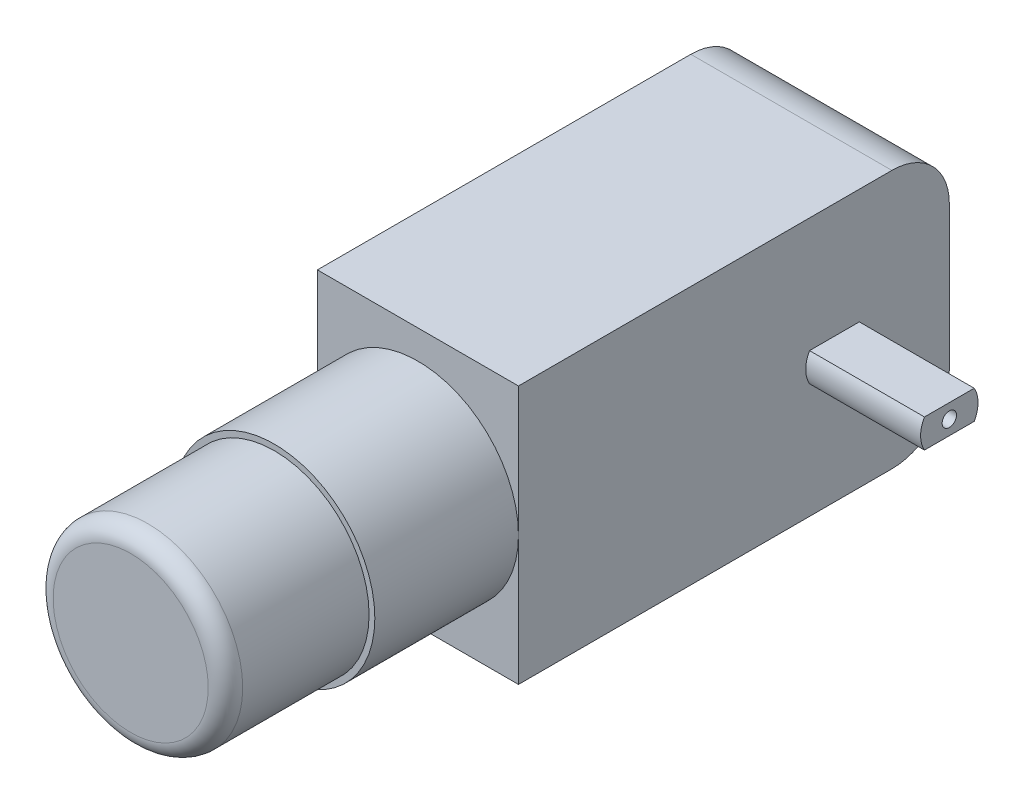
ISO-10303-21;
HEADER;
FILE_DESCRIPTION(('STEP AP214'),'2;1');
FILE_NAME('part.step','',(''),(''),'','','');
FILE_SCHEMA(('AUTOMOTIVE_DESIGN { 1 0 10303 214 1 1 1 1 }'));
ENDSEC;
DATA;
#1=APPLICATION_CONTEXT('core data for automotive mechanical design processes');
#2=APPLICATION_PROTOCOL_DEFINITION('international standard','automotive_design',2000,#1);
#3=PRODUCT_CONTEXT('',#1,'mechanical');
#4=PRODUCT('Part','Part','',(#3));
#5=PRODUCT_RELATED_PRODUCT_CATEGORY('part','',(#4));
#6=PRODUCT_DEFINITION_FORMATION('','',#4);
#7=PRODUCT_DEFINITION_CONTEXT('part definition',#1,'design');
#8=PRODUCT_DEFINITION('design','',#6,#7);
#9=PRODUCT_DEFINITION_SHAPE('','',#8);
#10=(LENGTH_UNIT() NAMED_UNIT(*) SI_UNIT(.MILLI.,.METRE.));
#11=(NAMED_UNIT(*) PLANE_ANGLE_UNIT() SI_UNIT($,.RADIAN.));
#12=(NAMED_UNIT(*) SI_UNIT($,.STERADIAN.) SOLID_ANGLE_UNIT());
#13=UNCERTAINTY_MEASURE_WITH_UNIT(LENGTH_MEASURE(1.E-05),#10,'distance_accuracy_value','');
#14=(GEOMETRIC_REPRESENTATION_CONTEXT(3) GLOBAL_UNCERTAINTY_ASSIGNED_CONTEXT((#13)) GLOBAL_UNIT_ASSIGNED_CONTEXT((#10,
#11,#12)) REPRESENTATION_CONTEXT('',''));
#15=CARTESIAN_POINT('',(0.,0.,0.));
#16=DIRECTION('',(0.,0.,1.));
#17=DIRECTION('',(1.,0.,0.));
#18=AXIS2_PLACEMENT_3D('',#15,#16,#17);
#19=CARTESIAN_POINT('',(0.,0.,0.));
#20=DIRECTION('',(-1.,0.,0.));
#21=DIRECTION('',(0.,0.,1.));
#22=AXIS2_PLACEMENT_3D('',#19,#20,#21);
#23=PLANE('',#22);
#24=DIRECTION('',(0.,1.,0.));
#25=VECTOR('',#24,1.);
#26=CARTESIAN_POINT('',(0.,-11.25,-18.75));
#27=LINE('',#26,#25);
#28=CARTESIAN_POINT('',(0.,-6.25,-18.75));
#29=VERTEX_POINT('',#28);
#30=CARTESIAN_POINT('',(0.,6.24999999999999,-18.75));
#31=VERTEX_POINT('',#30);
#32=EDGE_CURVE('E221',#29,#31,#27,.T.);
#33=ORIENTED_EDGE('',*,*,#32,.F.);
#34=CARTESIAN_POINT('',(0.,-6.25,-13.75));
#35=DIRECTION('',(-1.,0.,0.));
#36=DIRECTION('',(0.,0.,1.));
#37=AXIS2_PLACEMENT_3D('',#34,#35,#36);
#38=CIRCLE('',#37,5.);
#39=CARTESIAN_POINT('',(0.,-11.25,-13.75));
#40=VERTEX_POINT('',#39);
#41=EDGE_CURVE('E262',#29,#40,#38,.T.);
#42=ORIENTED_EDGE('',*,*,#41,.T.);
#43=DIRECTION('',(0.,0.,-1.));
#44=VECTOR('',#43,1.);
#45=CARTESIAN_POINT('',(0.,-11.25,18.75));
#46=LINE('',#45,#44);
#47=CARTESIAN_POINT('',(0.,-11.25,18.75));
#48=VERTEX_POINT('',#47);
#49=EDGE_CURVE('E226',#48,#40,#46,.T.);
#50=ORIENTED_EDGE('',*,*,#49,.F.);
#51=DIRECTION('',(0.,-1.,0.));
#52=VECTOR('',#51,1.);
#53=CARTESIAN_POINT('',(0.,-11.25,18.75));
#54=LINE('',#53,#52);
#55=CARTESIAN_POINT('',(0.,0.,18.75));
#56=VERTEX_POINT('',#55);
#57=EDGE_CURVE('E239',#56,#48,#54,.T.);
#58=ORIENTED_EDGE('',*,*,#57,.F.);
#59=CARTESIAN_POINT('',(0.,11.25,18.75));
#60=VERTEX_POINT('',#59);
#61=EDGE_CURVE('E240',#60,#56,#54,.T.);
#62=ORIENTED_EDGE('',*,*,#61,.F.);
#63=DIRECTION('',(0.,0.,1.));
#64=VECTOR('',#63,1.);
#65=CARTESIAN_POINT('',(0.,11.25,18.75));
#66=LINE('',#65,#64);
#67=CARTESIAN_POINT('',(0.,11.25,-13.75));
#68=VERTEX_POINT('',#67);
#69=EDGE_CURVE('E237',#68,#60,#66,.T.);
#70=ORIENTED_EDGE('',*,*,#69,.F.);
#71=CARTESIAN_POINT('',(0.,6.25,-13.75));
#72=DIRECTION('',(-1.,0.,0.));
#73=DIRECTION('',(0.,0.,1.));
#74=AXIS2_PLACEMENT_3D('',#71,#72,#73);
#75=CIRCLE('',#74,5.);
#76=EDGE_CURVE('E260',#68,#31,#75,.T.);
#77=ORIENTED_EDGE('',*,*,#76,.T.);
#78=EDGE_LOOP('',(#33,#42,#50,#58,#62,#70,#77));
#79=FACE_BOUND('',#78,.T.);
#80=DIRECTION('',(0.,0.,1.));
#81=VECTOR('',#80,1.);
#82=CARTESIAN_POINT('',(0.,-1.25000000000003,0.));
#83=LINE('',#82,#81);
#84=CARTESIAN_POINT('',(0.,-1.25000000000003,-10.9150635094611));
#85=VERTEX_POINT('',#84);
#86=CARTESIAN_POINT('',(0.,-1.25000000000003,-6.5849364905389));
#87=VERTEX_POINT('',#86);
#88=EDGE_CURVE('E56',#85,#87,#83,.T.);
#89=ORIENTED_EDGE('',*,*,#88,.F.);
#90=CARTESIAN_POINT('',(0.,0.,-8.75));
#91=DIRECTION('',(-1.,0.,0.));
#92=DIRECTION('',(0.,0.,1.));
#93=AXIS2_PLACEMENT_3D('',#90,#91,#92);
#94=CIRCLE('',#93,2.5);
#95=CARTESIAN_POINT('',(0.,1.24999999999997,-10.9150635094611));
#96=VERTEX_POINT('',#95);
#97=EDGE_CURVE('E168',#96,#85,#94,.T.);
#98=ORIENTED_EDGE('',*,*,#97,.F.);
#99=DIRECTION('',(0.,0.,1.));
#100=VECTOR('',#99,1.);
#101=CARTESIAN_POINT('',(0.,1.24999999999997,0.));
#102=LINE('',#101,#100);
#103=CARTESIAN_POINT('',(0.,1.24999999999997,-6.5849364905389));
#104=VERTEX_POINT('',#103);
#105=EDGE_CURVE('E165',#96,#104,#102,.T.);
#106=ORIENTED_EDGE('',*,*,#105,.T.);
#107=EDGE_CURVE('E61',#87,#104,#94,.T.);
#108=ORIENTED_EDGE('',*,*,#107,.F.);
#109=EDGE_LOOP('',(#89,#98,#106,#108));
#110=FACE_BOUND('',#109,.T.);
#111=ADVANCED_FACE('F41',(#79,#110),#23,.T.);
#112=CARTESIAN_POINT('',(17.5,-11.25,18.75));
#113=DIRECTION('',(0.,0.,-1.));
#114=DIRECTION('',(-1.,0.,0.));
#115=AXIS2_PLACEMENT_3D('',#112,#113,#114);
#116=PLANE('',#115);
#117=CARTESIAN_POINT('',(8.75,0.,18.75));
#118=DIRECTION('',(0.,0.,1.));
#119=DIRECTION('',(1.,0.,0.));
#120=AXIS2_PLACEMENT_3D('',#117,#118,#119);
#121=CIRCLE('',#120,8.75);
#122=CARTESIAN_POINT('',(17.5,0.,18.75));
#123=VERTEX_POINT('',#122);
#124=EDGE_CURVE('E169',#123,#56,#121,.T.);
#125=ORIENTED_EDGE('',*,*,#124,.F.);
#126=DIRECTION('',(0.,-1.,0.));
#127=VECTOR('',#126,1.);
#128=CARTESIAN_POINT('',(17.5,-11.25,18.75));
#129=LINE('',#128,#127);
#130=CARTESIAN_POINT('',(17.5,11.25,18.75));
#131=VERTEX_POINT('',#130);
#132=EDGE_CURVE('E229',#131,#123,#129,.T.);
#133=ORIENTED_EDGE('',*,*,#132,.F.);
#134=DIRECTION('',(-1.,0.,0.));
#135=VECTOR('',#134,1.);
#136=CARTESIAN_POINT('',(17.5,11.25,18.75));
#137=LINE('',#136,#135);
#138=EDGE_CURVE('E247',#131,#60,#137,.T.);
#139=ORIENTED_EDGE('',*,*,#138,.T.);
#140=ORIENTED_EDGE('',*,*,#61,.T.);
#141=EDGE_LOOP('',(#125,#133,#139,#140));
#142=FACE_BOUND('',#141,.T.);
#143=ADVANCED_FACE('F295',(#142),#116,.F.);
#144=CARTESIAN_POINT('',(17.5,-11.25,-18.75));
#145=DIRECTION('',(0.,0.,1.));
#146=DIRECTION('',(1.,0.,0.));
#147=AXIS2_PLACEMENT_3D('',#144,#145,#146);
#148=PLANE('',#147);
#149=DIRECTION('',(0.,1.,0.));
#150=VECTOR('',#149,1.);
#151=CARTESIAN_POINT('',(17.5,-11.25,-18.75));
#152=LINE('',#151,#150);
#153=CARTESIAN_POINT('',(17.5,-6.25,-18.75));
#154=VERTEX_POINT('',#153);
#155=CARTESIAN_POINT('',(17.5,6.24999999999999,-18.75));
#156=VERTEX_POINT('',#155);
#157=EDGE_CURVE('E222',#154,#156,#152,.T.);
#158=ORIENTED_EDGE('',*,*,#157,.F.);
#159=DIRECTION('',(-1.,0.,0.));
#160=VECTOR('',#159,1.);
#161=CARTESIAN_POINT('',(17.5,-6.25,-18.75));
#162=LINE('',#161,#160);
#163=EDGE_CURVE('E257',#154,#29,#162,.T.);
#164=ORIENTED_EDGE('',*,*,#163,.T.);
#165=ORIENTED_EDGE('',*,*,#32,.T.);
#166=DIRECTION('',(-1.,0.,0.));
#167=VECTOR('',#166,1.);
#168=CARTESIAN_POINT('',(17.5,6.25,-18.75));
#169=LINE('',#168,#167);
#170=EDGE_CURVE('E255',#31,#156,#169,.F.);
#171=ORIENTED_EDGE('',*,*,#170,.T.);
#172=EDGE_LOOP('',(#158,#164,#165,#171));
#173=FACE_BOUND('',#172,.T.);
#174=ADVANCED_FACE('F277',(#173),#148,.F.);
#175=CARTESIAN_POINT('',(17.5,11.25,18.75));
#176=DIRECTION('',(0.,-1.,0.));
#177=DIRECTION('',(0.,0.,-1.));
#178=AXIS2_PLACEMENT_3D('',#175,#176,#177);
#179=PLANE('',#178);
#180=DIRECTION('',(0.,0.,1.));
#181=VECTOR('',#180,1.);
#182=CARTESIAN_POINT('',(17.5,11.25,18.75));
#183=LINE('',#182,#181);
#184=CARTESIAN_POINT('',(17.5,11.25,-13.75));
#185=VERTEX_POINT('',#184);
#186=EDGE_CURVE('E225',#185,#131,#183,.T.);
#187=ORIENTED_EDGE('',*,*,#186,.F.);
#188=DIRECTION('',(-1.,0.,0.));
#189=VECTOR('',#188,1.);
#190=CARTESIAN_POINT('',(17.5,11.25,-13.75));
#191=LINE('',#190,#189);
#192=EDGE_CURVE('E11',#185,#68,#191,.T.);
#193=ORIENTED_EDGE('',*,*,#192,.T.);
#194=ORIENTED_EDGE('',*,*,#69,.T.);
#195=ORIENTED_EDGE('',*,*,#138,.F.);
#196=EDGE_LOOP('',(#187,#193,#194,#195));
#197=FACE_BOUND('',#196,.T.);
#198=ADVANCED_FACE('F330',(#197),#179,.F.);
#199=EDGE_CURVE('E174',#56,#123,#121,.T.);
#200=ORIENTED_EDGE('',*,*,#199,.F.);
#201=ORIENTED_EDGE('',*,*,#57,.T.);
#202=DIRECTION('',(-1.,0.,0.));
#203=VECTOR('',#202,1.);
#204=CARTESIAN_POINT('',(17.5,-11.25,18.75));
#205=LINE('',#204,#203);
#206=CARTESIAN_POINT('',(17.5,-11.25,18.75));
#207=VERTEX_POINT('',#206);
#208=EDGE_CURVE('E234',#207,#48,#205,.T.);
#209=ORIENTED_EDGE('',*,*,#208,.F.);
#210=EDGE_CURVE('E228',#123,#207,#129,.T.);
#211=ORIENTED_EDGE('',*,*,#210,.F.);
#212=EDGE_LOOP('',(#200,#201,#209,#211));
#213=FACE_BOUND('',#212,.T.);
#214=ADVANCED_FACE('F289',(#213),#116,.F.);
#215=CARTESIAN_POINT('',(17.5,-11.25,18.75));
#216=DIRECTION('',(0.,1.,0.));
#217=DIRECTION('',(0.,0.,1.));
#218=AXIS2_PLACEMENT_3D('',#215,#216,#217);
#219=PLANE('',#218);
#220=ORIENTED_EDGE('',*,*,#49,.T.);
#221=DIRECTION('',(-1.,0.,0.));
#222=VECTOR('',#221,1.);
#223=CARTESIAN_POINT('',(17.5,-11.25,-13.75));
#224=LINE('',#223,#222);
#225=CARTESIAN_POINT('',(17.5,-11.25,-13.75));
#226=VERTEX_POINT('',#225);
#227=EDGE_CURVE('E264',#40,#226,#224,.F.);
#228=ORIENTED_EDGE('',*,*,#227,.T.);
#229=DIRECTION('',(0.,0.,-1.));
#230=VECTOR('',#229,1.);
#231=CARTESIAN_POINT('',(17.5,-11.25,18.75));
#232=LINE('',#231,#230);
#233=EDGE_CURVE('E231',#207,#226,#232,.T.);
#234=ORIENTED_EDGE('',*,*,#233,.F.);
#235=ORIENTED_EDGE('',*,*,#208,.T.);
#236=EDGE_LOOP('',(#220,#228,#234,#235));
#237=FACE_BOUND('',#236,.T.);
#238=ADVANCED_FACE('F285',(#237),#219,.F.);
#239=CARTESIAN_POINT('',(17.5,0.,0.));
#240=DIRECTION('',(-1.,0.,0.));
#241=DIRECTION('',(0.,0.,1.));
#242=AXIS2_PLACEMENT_3D('',#239,#240,#241);
#243=PLANE('',#242);
#244=DIRECTION('',(0.,0.,-1.));
#245=VECTOR('',#244,1.);
#246=CARTESIAN_POINT('',(17.5,-1.25352081167518,0.));
#247=LINE('',#246,#245);
#248=CARTESIAN_POINT('',(17.5,-1.25352081167518,-6.5849364905389));
#249=VERTEX_POINT('',#248);
#250=CARTESIAN_POINT('',(17.5,-1.25352081167518,-10.9150635094611));
#251=VERTEX_POINT('',#250);
#252=EDGE_CURVE('E184',#249,#251,#247,.T.);
#253=ORIENTED_EDGE('',*,*,#252,.F.);
#254=CARTESIAN_POINT('',(17.5,-0.00352081167518357,-8.75));
#255=DIRECTION('',(1.,0.,0.));
#256=DIRECTION('',(0.,0.,-1.));
#257=AXIS2_PLACEMENT_3D('',#254,#255,#256);
#258=CIRCLE('',#257,2.5);
#259=CARTESIAN_POINT('',(17.5,1.24647918832482,-6.5849364905389));
#260=VERTEX_POINT('',#259);
#261=EDGE_CURVE('E206',#260,#249,#258,.T.);
#262=ORIENTED_EDGE('',*,*,#261,.F.);
#263=DIRECTION('',(0.,0.,-1.));
#264=VECTOR('',#263,1.);
#265=CARTESIAN_POINT('',(17.5,1.24647918832482,0.));
#266=LINE('',#265,#264);
#267=CARTESIAN_POINT('',(17.5,1.24647918832482,-10.9150635094611));
#268=VERTEX_POINT('',#267);
#269=EDGE_CURVE('E205',#260,#268,#266,.T.);
#270=ORIENTED_EDGE('',*,*,#269,.T.);
#271=EDGE_CURVE('E202',#251,#268,#258,.T.);
#272=ORIENTED_EDGE('',*,*,#271,.F.);
#273=EDGE_LOOP('',(#253,#262,#270,#272));
#274=FACE_BOUND('',#273,.T.);
#275=ORIENTED_EDGE('',*,*,#233,.T.);
#276=CARTESIAN_POINT('',(17.5,-6.25,-13.75));
#277=DIRECTION('',(-1.,0.,0.));
#278=DIRECTION('',(0.,0.,1.));
#279=AXIS2_PLACEMENT_3D('',#276,#277,#278);
#280=CIRCLE('',#279,5.);
#281=EDGE_CURVE('E49',#226,#154,#280,.F.);
#282=ORIENTED_EDGE('',*,*,#281,.T.);
#283=ORIENTED_EDGE('',*,*,#157,.T.);
#284=CARTESIAN_POINT('',(17.5,6.25,-13.75));
#285=DIRECTION('',(-1.,0.,0.));
#286=DIRECTION('',(0.,0.,1.));
#287=AXIS2_PLACEMENT_3D('',#284,#285,#286);
#288=CIRCLE('',#287,5.);
#289=EDGE_CURVE('E266',#156,#185,#288,.F.);
#290=ORIENTED_EDGE('',*,*,#289,.T.);
#291=ORIENTED_EDGE('',*,*,#186,.T.);
#292=ORIENTED_EDGE('',*,*,#132,.T.);
#293=ORIENTED_EDGE('',*,*,#210,.T.);
#294=EDGE_LOOP('',(#275,#282,#283,#290,#291,#292,#293));
#295=FACE_BOUND('',#294,.T.);
#296=ADVANCED_FACE('F270',(#274,#295),#243,.F.);
#297=CARTESIAN_POINT('',(27.5,-1.25352081167518,0.));
#298=DIRECTION('',(0.,1.,0.));
#299=DIRECTION('',(0.,0.,1.));
#300=AXIS2_PLACEMENT_3D('',#297,#298,#299);
#301=PLANE('',#300);
#302=ORIENTED_EDGE('',*,*,#252,.T.);
#303=DIRECTION('',(-1.,0.,0.));
#304=VECTOR('',#303,1.);
#305=CARTESIAN_POINT('',(27.5,-1.25352081167518,-10.9150635094611));
#306=LINE('',#305,#304);
#307=CARTESIAN_POINT('',(27.5,-1.25352081167518,-10.9150635094611));
#308=VERTEX_POINT('',#307);
#309=EDGE_CURVE('E218',#308,#251,#306,.T.);
#310=ORIENTED_EDGE('',*,*,#309,.F.);
#311=DIRECTION('',(0.,0.,-1.));
#312=VECTOR('',#311,1.);
#313=CARTESIAN_POINT('',(27.5,-1.25352081167518,0.));
#314=LINE('',#313,#312);
#315=CARTESIAN_POINT('',(27.5,-1.25352081167518,-6.5849364905389));
#316=VERTEX_POINT('',#315);
#317=EDGE_CURVE('E186',#316,#308,#314,.T.);
#318=ORIENTED_EDGE('',*,*,#317,.F.);
#319=DIRECTION('',(-1.,0.,0.));
#320=VECTOR('',#319,1.);
#321=CARTESIAN_POINT('',(27.5,-1.25352081167518,-6.5849364905389));
#322=LINE('',#321,#320);
#323=EDGE_CURVE('E199',#316,#249,#322,.T.);
#324=ORIENTED_EDGE('',*,*,#323,.T.);
#325=EDGE_LOOP('',(#302,#310,#318,#324));
#326=FACE_BOUND('',#325,.T.);
#327=ADVANCED_FACE('F478',(#326),#301,.F.);
#328=CARTESIAN_POINT('',(27.5,-0.00352081167518357,-8.75));
#329=DIRECTION('',(-1.,0.,0.));
#330=DIRECTION('',(0.,0.,1.));
#331=AXIS2_PLACEMENT_3D('',#328,#329,#330);
#332=CYLINDRICAL_SURFACE('',#331,2.5);
#333=ORIENTED_EDGE('',*,*,#271,.T.);
#334=DIRECTION('',(-1.,0.,0.));
#335=VECTOR('',#334,1.);
#336=CARTESIAN_POINT('',(27.5,1.24647918832482,-10.9150635094611));
#337=LINE('',#336,#335);
#338=CARTESIAN_POINT('',(27.5,1.24647918832482,-10.9150635094611));
#339=VERTEX_POINT('',#338);
#340=EDGE_CURVE('E215',#339,#268,#337,.T.);
#341=ORIENTED_EDGE('',*,*,#340,.F.);
#342=CARTESIAN_POINT('',(27.5,-0.00352081167518357,-8.75));
#343=DIRECTION('',(1.,0.,0.));
#344=DIRECTION('',(0.,0.,-1.));
#345=AXIS2_PLACEMENT_3D('',#342,#343,#344);
#346=CIRCLE('',#345,2.5);
#347=EDGE_CURVE('E189',#308,#339,#346,.T.);
#348=ORIENTED_EDGE('',*,*,#347,.F.);
#349=ORIENTED_EDGE('',*,*,#309,.T.);
#350=EDGE_LOOP('',(#333,#341,#348,#349));
#351=FACE_BOUND('',#350,.T.);
#352=ADVANCED_FACE('F484',(#351),#332,.T.);
#353=CARTESIAN_POINT('',(27.5,1.24647918832482,0.));
#354=DIRECTION('',(0.,1.,0.));
#355=DIRECTION('',(0.,0.,1.));
#356=AXIS2_PLACEMENT_3D('',#353,#354,#355);
#357=PLANE('',#356);
#358=ORIENTED_EDGE('',*,*,#269,.F.);
#359=DIRECTION('',(-1.,0.,0.));
#360=VECTOR('',#359,1.);
#361=CARTESIAN_POINT('',(27.5,1.24647918832482,-6.5849364905389));
#362=LINE('',#361,#360);
#363=CARTESIAN_POINT('',(27.5,1.24647918832482,-6.5849364905389));
#364=VERTEX_POINT('',#363);
#365=EDGE_CURVE('E212',#364,#260,#362,.T.);
#366=ORIENTED_EDGE('',*,*,#365,.F.);
#367=DIRECTION('',(0.,0.,-1.));
#368=VECTOR('',#367,1.);
#369=CARTESIAN_POINT('',(27.5,1.24647918832482,0.));
#370=LINE('',#369,#368);
#371=EDGE_CURVE('E192',#364,#339,#370,.T.);
#372=ORIENTED_EDGE('',*,*,#371,.T.);
#373=ORIENTED_EDGE('',*,*,#340,.T.);
#374=EDGE_LOOP('',(#358,#366,#372,#373));
#375=FACE_BOUND('',#374,.T.);
#376=ADVANCED_FACE('F492',(#375),#357,.T.);
#377=ORIENTED_EDGE('',*,*,#261,.T.);
#378=ORIENTED_EDGE('',*,*,#323,.F.);
#379=EDGE_CURVE('E193',#364,#316,#346,.T.);
#380=ORIENTED_EDGE('',*,*,#379,.F.);
#381=ORIENTED_EDGE('',*,*,#365,.T.);
#382=EDGE_LOOP('',(#377,#378,#380,#381));
#383=FACE_BOUND('',#382,.T.);
#384=ADVANCED_FACE('F495',(#383),#332,.T.);
#385=CARTESIAN_POINT('',(27.5,-0.00352081167518357,-8.75));
#386=DIRECTION('',(-1.,0.,0.));
#387=DIRECTION('',(0.,0.,1.));
#388=AXIS2_PLACEMENT_3D('',#385,#386,#387);
#389=CYLINDRICAL_SURFACE('',#388,0.624999999999999);
#390=CARTESIAN_POINT('',(27.5,-0.00352081167518357,-8.75));
#391=DIRECTION('',(1.,0.,0.));
#392=DIRECTION('',(0.,0.,-1.));
#393=AXIS2_PLACEMENT_3D('',#390,#391,#392);
#394=CIRCLE('',#393,0.624999999999999);
#395=CARTESIAN_POINT('',(27.5,-0.00352081167518357,-9.375));
#396=VERTEX_POINT('',#395);
#397=EDGE_CURVE('E196',#396,#396,#394,.T.);
#398=ORIENTED_EDGE('',*,*,#397,.T.);
#399=EDGE_LOOP('',(#398));
#400=FACE_BOUND('',#399,.T.);
#401=CARTESIAN_POINT('',(17.5,-0.00352081167518357,-8.75));
#402=DIRECTION('',(1.,0.,0.));
#403=DIRECTION('',(0.,0.,-1.));
#404=AXIS2_PLACEMENT_3D('',#401,#402,#403);
#405=CIRCLE('',#404,0.624999999999999);
#406=CARTESIAN_POINT('',(17.5,-0.00352081167518357,-9.375));
#407=VERTEX_POINT('',#406);
#408=EDGE_CURVE('E190',#407,#407,#405,.T.);
#409=ORIENTED_EDGE('',*,*,#408,.F.);
#410=EDGE_LOOP('',(#409));
#411=FACE_BOUND('',#410,.T.);
#412=ADVANCED_FACE('F457',(#400,#411),#389,.F.);
#413=CARTESIAN_POINT('',(27.5,0.,0.));
#414=DIRECTION('',(1.,0.,0.));
#415=DIRECTION('',(0.,0.,-1.));
#416=AXIS2_PLACEMENT_3D('',#413,#414,#415);
#417=PLANE('',#416);
#418=ORIENTED_EDGE('',*,*,#317,.T.);
#419=ORIENTED_EDGE('',*,*,#347,.T.);
#420=ORIENTED_EDGE('',*,*,#371,.F.);
#421=ORIENTED_EDGE('',*,*,#379,.T.);
#422=EDGE_LOOP('',(#418,#419,#420,#421));
#423=FACE_BOUND('',#422,.T.);
#424=ORIENTED_EDGE('',*,*,#397,.F.);
#425=EDGE_LOOP('',(#424));
#426=FACE_BOUND('',#425,.T.);
#427=ADVANCED_FACE('F312',(#423,#426),#417,.T.);
#428=ORIENTED_EDGE('',*,*,#408,.T.);
#429=EDGE_LOOP('',(#428));
#430=FACE_BOUND('',#429,.T.);
#431=ADVANCED_FACE('F302',(#430),#243,.F.);
#432=CARTESIAN_POINT('',(8.75,0.,31.25));
#433=DIRECTION('',(0.,0.,-1.));
#434=DIRECTION('',(-1.,0.,0.));
#435=AXIS2_PLACEMENT_3D('',#432,#433,#434);
#436=CYLINDRICAL_SURFACE('',#435,8.75);
#437=CARTESIAN_POINT('',(8.75,0.,31.25));
#438=DIRECTION('',(0.,0.,1.));
#439=DIRECTION('',(1.,0.,0.));
#440=AXIS2_PLACEMENT_3D('',#437,#438,#439);
#441=CIRCLE('',#440,8.75);
#442=CARTESIAN_POINT('',(17.5,0.,31.25));
#443=VERTEX_POINT('',#442);
#444=EDGE_CURVE('E172',#443,#443,#441,.T.);
#445=ORIENTED_EDGE('',*,*,#444,.F.);
#446=EDGE_LOOP('',(#445));
#447=FACE_BOUND('',#446,.T.);
#448=ORIENTED_EDGE('',*,*,#124,.T.);
#449=ORIENTED_EDGE('',*,*,#199,.T.);
#450=EDGE_LOOP('',(#448,#449));
#451=FACE_BOUND('',#450,.T.);
#452=ADVANCED_FACE('F299',(#447,#451),#436,.T.);
#453=CARTESIAN_POINT('',(8.75,0.,31.25));
#454=DIRECTION('',(0.,0.,1.));
#455=DIRECTION('',(1.,0.,0.));
#456=AXIS2_PLACEMENT_3D('',#453,#454,#455);
#457=PLANE('',#456);
#458=CARTESIAN_POINT('',(8.75,0.,31.25));
#459=DIRECTION('',(0.,0.,1.));
#460=DIRECTION('',(1.,0.,0.));
#461=AXIS2_PLACEMENT_3D('',#458,#459,#460);
#462=CIRCLE('',#461,8.25);
#463=CARTESIAN_POINT('',(17.,0.,31.25));
#464=VERTEX_POINT('',#463);
#465=EDGE_CURVE('E179',#464,#464,#462,.T.);
#466=ORIENTED_EDGE('',*,*,#465,.F.);
#467=EDGE_LOOP('',(#466));
#468=FACE_BOUND('',#467,.T.);
#469=ORIENTED_EDGE('',*,*,#444,.T.);
#470=EDGE_LOOP('',(#469));
#471=FACE_BOUND('',#470,.T.);
#472=ADVANCED_FACE('F301',(#468,#471),#457,.T.);
#473=CARTESIAN_POINT('',(8.75,0.,43.75));
#474=DIRECTION('',(0.,0.,-1.));
#475=DIRECTION('',(-1.,0.,0.));
#476=AXIS2_PLACEMENT_3D('',#473,#474,#475);
#477=CYLINDRICAL_SURFACE('',#476,8.25);
#478=CARTESIAN_POINT('',(8.75,0.,42.25));
#479=DIRECTION('',(0.,0.,1.));
#480=DIRECTION('',(1.,0.,0.));
#481=AXIS2_PLACEMENT_3D('',#478,#479,#480);
#482=CIRCLE('',#481,8.25);
#483=CARTESIAN_POINT('',(17.,0.,42.25));
#484=VERTEX_POINT('',#483);
#485=EDGE_CURVE('E252',#484,#484,#482,.F.);
#486=ORIENTED_EDGE('',*,*,#485,.T.);
#487=EDGE_LOOP('',(#486));
#488=FACE_BOUND('',#487,.T.);
#489=ORIENTED_EDGE('',*,*,#465,.T.);
#490=EDGE_LOOP('',(#489));
#491=FACE_BOUND('',#490,.T.);
#492=ADVANCED_FACE('F309',(#488,#491),#477,.T.);
#493=CARTESIAN_POINT('',(8.75,0.,43.75));
#494=DIRECTION('',(0.,0.,1.));
#495=DIRECTION('',(1.,0.,0.));
#496=AXIS2_PLACEMENT_3D('',#493,#494,#495);
#497=PLANE('',#496);
#498=CARTESIAN_POINT('',(8.75,0.,43.75));
#499=DIRECTION('',(0.,0.,1.));
#500=DIRECTION('',(1.,0.,0.));
#501=AXIS2_PLACEMENT_3D('',#498,#499,#500);
#502=CIRCLE('',#501,6.75);
#503=CARTESIAN_POINT('',(15.5,0.,43.75));
#504=VERTEX_POINT('',#503);
#505=EDGE_CURVE('E182',#504,#504,#502,.T.);
#506=ORIENTED_EDGE('',*,*,#505,.T.);
#507=EDGE_LOOP('',(#506));
#508=FACE_BOUND('',#507,.T.);
#509=ADVANCED_FACE('F338',(#508),#497,.T.);
#510=CARTESIAN_POINT('',(8.75,0.,42.25));
#511=DIRECTION('',(0.,0.,1.));
#512=DIRECTION('',(1.,0.,0.));
#513=AXIS2_PLACEMENT_3D('',#510,#511,#512);
#514=TOROIDAL_SURFACE('',#513,6.75,1.5);
#515=ORIENTED_EDGE('',*,*,#485,.F.);
#516=EDGE_LOOP('',(#515));
#517=FACE_BOUND('',#516,.T.);
#518=ORIENTED_EDGE('',*,*,#505,.F.);
#519=EDGE_LOOP('',(#518));
#520=FACE_BOUND('',#519,.T.);
#521=ADVANCED_FACE('F336',(#517,#520),#514,.T.);
#522=CARTESIAN_POINT('',(17.5,-6.25,-13.75));
#523=DIRECTION('',(-1.,0.,0.));
#524=DIRECTION('',(0.,0.,1.));
#525=AXIS2_PLACEMENT_3D('',#522,#523,#524);
#526=CYLINDRICAL_SURFACE('',#525,5.);
#527=ORIENTED_EDGE('',*,*,#281,.F.);
#528=ORIENTED_EDGE('',*,*,#227,.F.);
#529=ORIENTED_EDGE('',*,*,#41,.F.);
#530=ORIENTED_EDGE('',*,*,#163,.F.);
#531=EDGE_LOOP('',(#527,#528,#529,#530));
#532=FACE_BOUND('',#531,.T.);
#533=ADVANCED_FACE('F280',(#532),#526,.T.);
#534=CARTESIAN_POINT('',(17.5,6.25,-13.75));
#535=DIRECTION('',(-1.,0.,0.));
#536=DIRECTION('',(0.,0.,1.));
#537=AXIS2_PLACEMENT_3D('',#534,#535,#536);
#538=CYLINDRICAL_SURFACE('',#537,5.);
#539=ORIENTED_EDGE('',*,*,#289,.F.);
#540=ORIENTED_EDGE('',*,*,#170,.F.);
#541=ORIENTED_EDGE('',*,*,#76,.F.);
#542=ORIENTED_EDGE('',*,*,#192,.F.);
#543=EDGE_LOOP('',(#539,#540,#541,#542));
#544=FACE_BOUND('',#543,.T.);
#545=ADVANCED_FACE('F43',(#544),#538,.T.);
#546=CARTESIAN_POINT('',(-10.,0.,-8.75));
#547=DIRECTION('',(1.,0.,0.));
#548=DIRECTION('',(0.,0.,-1.));
#549=AXIS2_PLACEMENT_3D('',#546,#547,#548);
#550=CYLINDRICAL_SURFACE('',#549,2.5);
#551=ORIENTED_EDGE('',*,*,#97,.T.);
#552=DIRECTION('',(1.,0.,0.));
#553=VECTOR('',#552,1.);
#554=CARTESIAN_POINT('',(-10.,-1.25000000000003,-10.9150635094611));
#555=LINE('',#554,#553);
#556=CARTESIAN_POINT('',(-10.,-1.25000000000003,-10.9150635094611));
#557=VERTEX_POINT('',#556);
#558=EDGE_CURVE('E149',#557,#85,#555,.T.);
#559=ORIENTED_EDGE('',*,*,#558,.F.);
#560=CARTESIAN_POINT('',(-10.,0.,-8.75));
#561=DIRECTION('',(-1.,0.,0.));
#562=DIRECTION('',(0.,0.,1.));
#563=AXIS2_PLACEMENT_3D('',#560,#561,#562);
#564=CIRCLE('',#563,2.5);
#565=CARTESIAN_POINT('',(-10.,1.24999999999997,-10.9150635094611));
#566=VERTEX_POINT('',#565);
#567=EDGE_CURVE('E156',#566,#557,#564,.T.);
#568=ORIENTED_EDGE('',*,*,#567,.F.);
#569=DIRECTION('',(1.,0.,0.));
#570=VECTOR('',#569,1.);
#571=CARTESIAN_POINT('',(-10.,1.24999999999997,-10.9150635094611));
#572=LINE('',#571,#570);
#573=EDGE_CURVE('E370',#566,#96,#572,.T.);
#574=ORIENTED_EDGE('',*,*,#573,.T.);
#575=EDGE_LOOP('',(#551,#559,#568,#574));
#576=FACE_BOUND('',#575,.T.);
#577=ADVANCED_FACE('F167',(#576),#550,.T.);
#578=CARTESIAN_POINT('',(-10.,-1.25000000000003,0.));
#579=DIRECTION('',(0.,1.,0.));
#580=DIRECTION('',(0.,0.,1.));
#581=AXIS2_PLACEMENT_3D('',#578,#579,#580);
#582=PLANE('',#581);
#583=ORIENTED_EDGE('',*,*,#88,.T.);
#584=DIRECTION('',(1.,0.,0.));
#585=VECTOR('',#584,1.);
#586=CARTESIAN_POINT('',(-10.,-1.25000000000003,-6.5849364905389));
#587=LINE('',#586,#585);
#588=CARTESIAN_POINT('',(-10.,-1.25000000000003,-6.5849364905389));
#589=VERTEX_POINT('',#588);
#590=EDGE_CURVE('E152',#589,#87,#587,.T.);
#591=ORIENTED_EDGE('',*,*,#590,.F.);
#592=DIRECTION('',(0.,0.,1.));
#593=VECTOR('',#592,1.);
#594=CARTESIAN_POINT('',(-10.,-1.25000000000003,0.));
#595=LINE('',#594,#593);
#596=EDGE_CURVE('E145',#557,#589,#595,.T.);
#597=ORIENTED_EDGE('',*,*,#596,.F.);
#598=ORIENTED_EDGE('',*,*,#558,.T.);
#599=EDGE_LOOP('',(#583,#591,#597,#598));
#600=FACE_BOUND('',#599,.T.);
#601=ADVANCED_FACE('F147',(#600),#582,.F.);
#602=ORIENTED_EDGE('',*,*,#107,.T.);
#603=DIRECTION('',(1.,0.,0.));
#604=VECTOR('',#603,1.);
#605=CARTESIAN_POINT('',(-10.,1.24999999999997,-6.5849364905389));
#606=LINE('',#605,#604);
#607=CARTESIAN_POINT('',(-10.,1.24999999999997,-6.5849364905389));
#608=VERTEX_POINT('',#607);
#609=EDGE_CURVE('E175',#608,#104,#606,.T.);
#610=ORIENTED_EDGE('',*,*,#609,.F.);
#611=EDGE_CURVE('E155',#589,#608,#564,.T.);
#612=ORIENTED_EDGE('',*,*,#611,.F.);
#613=ORIENTED_EDGE('',*,*,#590,.T.);
#614=EDGE_LOOP('',(#602,#610,#612,#613));
#615=FACE_BOUND('',#614,.T.);
#616=ADVANCED_FACE('F349',(#615),#550,.T.);
#617=CARTESIAN_POINT('',(-10.,1.24999999999997,0.));
#618=DIRECTION('',(0.,1.,0.));
#619=DIRECTION('',(0.,0.,1.));
#620=AXIS2_PLACEMENT_3D('',#617,#618,#619);
#621=PLANE('',#620);
#622=ORIENTED_EDGE('',*,*,#105,.F.);
#623=ORIENTED_EDGE('',*,*,#573,.F.);
#624=DIRECTION('',(0.,0.,1.));
#625=VECTOR('',#624,1.);
#626=CARTESIAN_POINT('',(-10.,1.24999999999997,0.));
#627=LINE('',#626,#625);
#628=EDGE_CURVE('E162',#566,#608,#627,.T.);
#629=ORIENTED_EDGE('',*,*,#628,.T.);
#630=ORIENTED_EDGE('',*,*,#609,.T.);
#631=EDGE_LOOP('',(#622,#623,#629,#630));
#632=FACE_BOUND('',#631,.T.);
#633=ADVANCED_FACE('F357',(#632),#621,.T.);
#634=CARTESIAN_POINT('',(-10.,0.,0.));
#635=DIRECTION('',(-1.,0.,0.));
#636=DIRECTION('',(0.,0.,1.));
#637=AXIS2_PLACEMENT_3D('',#634,#635,#636);
#638=PLANE('',#637);
#639=ORIENTED_EDGE('',*,*,#567,.T.);
#640=ORIENTED_EDGE('',*,*,#596,.T.);
#641=ORIENTED_EDGE('',*,*,#611,.T.);
#642=ORIENTED_EDGE('',*,*,#628,.F.);
#643=EDGE_LOOP('',(#639,#640,#641,#642));
#644=FACE_BOUND('',#643,.T.);
#645=ADVANCED_FACE('F160',(#644),#638,.T.);
#646=CLOSED_SHELL('',(#111,#143,#174,#198,#214,#238,#296,#327,#352,#376,#384,#412,#427,#431,
#452,#472,#492,#509,#521,#533,#545,#577,#601,#616,#633,#645));
#647=MANIFOLD_SOLID_BREP('B2',#646);
#648=ADVANCED_BREP_SHAPE_REPRESENTATION('',(#18,#647),#14);
#649=SHAPE_DEFINITION_REPRESENTATION(#9,#648);
ENDSEC;
END-ISO-10303-21;
